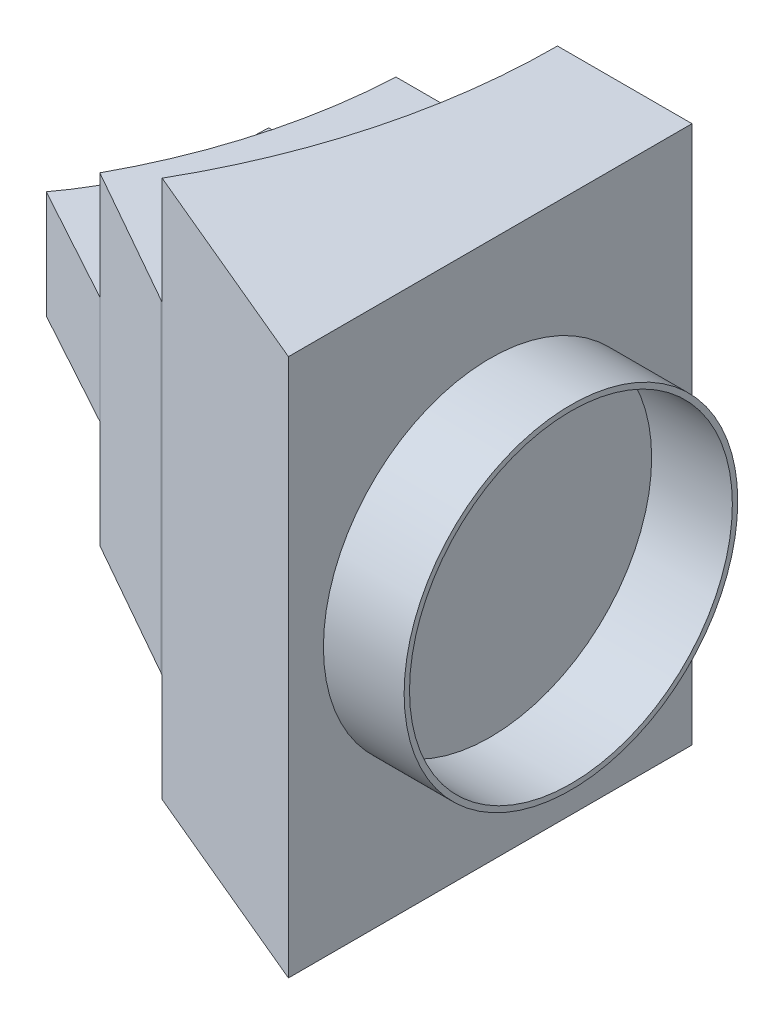
ISO-10303-21;
HEADER;
FILE_DESCRIPTION(('STEP AP214'),'2;1');
FILE_NAME('part.step','',(''),(''),'','','');
FILE_SCHEMA(('AUTOMOTIVE_DESIGN { 1 0 10303 214 1 1 1 1 }'));
ENDSEC;
DATA;
#1=APPLICATION_CONTEXT('core data for automotive mechanical design processes');
#2=APPLICATION_PROTOCOL_DEFINITION('international standard','automotive_design',2000,#1);
#3=PRODUCT_CONTEXT('',#1,'mechanical');
#4=PRODUCT('Part','Part','',(#3));
#5=PRODUCT_RELATED_PRODUCT_CATEGORY('part','',(#4));
#6=PRODUCT_DEFINITION_FORMATION('','',#4);
#7=PRODUCT_DEFINITION_CONTEXT('part definition',#1,'design');
#8=PRODUCT_DEFINITION('design','',#6,#7);
#9=PRODUCT_DEFINITION_SHAPE('','',#8);
#10=(LENGTH_UNIT() NAMED_UNIT(*) SI_UNIT(.MILLI.,.METRE.));
#11=(NAMED_UNIT(*) PLANE_ANGLE_UNIT() SI_UNIT($,.RADIAN.));
#12=(NAMED_UNIT(*) SI_UNIT($,.STERADIAN.) SOLID_ANGLE_UNIT());
#13=UNCERTAINTY_MEASURE_WITH_UNIT(LENGTH_MEASURE(1.E-05),#10,'distance_accuracy_value','');
#14=(GEOMETRIC_REPRESENTATION_CONTEXT(3) GLOBAL_UNCERTAINTY_ASSIGNED_CONTEXT((#13)) GLOBAL_UNIT_ASSIGNED_CONTEXT((#10,
#11,#12)) REPRESENTATION_CONTEXT('',''));
#15=CARTESIAN_POINT('',(0.,0.,0.));
#16=DIRECTION('',(0.,0.,1.));
#17=DIRECTION('',(1.,0.,0.));
#18=AXIS2_PLACEMENT_3D('',#15,#16,#17);
#19=CARTESIAN_POINT('',(0.,60.,0.));
#20=DIRECTION('',(0.,-1.,0.));
#21=DIRECTION('',(0.,0.,-1.));
#22=AXIS2_PLACEMENT_3D('',#19,#20,#21);
#23=CYLINDRICAL_SURFACE('',#22,100.);
#24=CARTESIAN_POINT('',(-1.01307850997046E-12,40.,-3.33066907387547E-13));
#25=DIRECTION('',(0.,1.,0.));
#26=DIRECTION('',(0.,0.,-1.));
#27=AXIS2_PLACEMENT_3D('',#24,#25,#26);
#28=CIRCLE('',#27,100.000000000001);
#29=CARTESIAN_POINT('',(87.7609616658955,40.,47.9376011860963));
#30=VERTEX_POINT('',#29);
#31=CARTESIAN_POINT('',(99.8749217771909,40.,5.));
#32=VERTEX_POINT('',#31);
#33=EDGE_CURVE('E143',#30,#32,#28,.T.);
#34=ORIENTED_EDGE('',*,*,#33,.F.);
#35=DIRECTION('',(0.,-1.,0.));
#36=VECTOR('',#35,1.);
#37=CARTESIAN_POINT('',(87.7609616658955,60.,47.9376011860963));
#38=LINE('',#37,#36);
#39=CARTESIAN_POINT('',(87.7609616658955,60.,47.9376011860963));
#40=VERTEX_POINT('',#39);
#41=EDGE_CURVE('E41',#40,#30,#38,.T.);
#42=ORIENTED_EDGE('',*,*,#41,.F.);
#43=CARTESIAN_POINT('',(0.,60.,0.));
#44=DIRECTION('',(0.,-1.,0.));
#45=DIRECTION('',(0.,0.,-1.));
#46=AXIS2_PLACEMENT_3D('',#43,#44,#45);
#47=CIRCLE('',#46,100.);
#48=CARTESIAN_POINT('',(99.8749217771909,60.,5.));
#49=VERTEX_POINT('',#48);
#50=EDGE_CURVE('E57',#49,#40,#47,.T.);
#51=ORIENTED_EDGE('',*,*,#50,.F.);
#52=DIRECTION('',(0.,-1.,0.));
#53=VECTOR('',#52,1.);
#54=CARTESIAN_POINT('',(99.8749217771909,60.,5.));
#55=LINE('',#54,#53);
#56=EDGE_CURVE('E115',#49,#32,#55,.T.);
#57=ORIENTED_EDGE('',*,*,#56,.T.);
#58=EDGE_LOOP('',(#34,#42,#51,#57));
#59=FACE_BOUND('',#58,.T.);
#60=ADVANCED_FACE('F33',(#59),#23,.F.);
#61=CARTESIAN_POINT('',(87.7609616658955,60.,47.9376011860963));
#62=DIRECTION('',(0.492049327323064,0.,-0.87056732047609));
#63=DIRECTION('',(-0.87056732047609,0.,-0.492049327323064));
#64=AXIS2_PLACEMENT_3D('',#61,#62,#63);
#65=PLANE('',#64);
#66=DIRECTION('',(0.870567320476091,0.,0.492049327323064));
#67=VECTOR('',#66,1.);
#68=CARTESIAN_POINT('',(87.7609616658955,0.,47.9376011860963));
#69=LINE('',#68,#67);
#70=CARTESIAN_POINT('',(87.7609616658955,0.,47.9376011860963));
#71=VERTEX_POINT('',#70);
#72=CARTESIAN_POINT('',(113.877981280178,0.,62.6990810057883));
#73=VERTEX_POINT('',#72);
#74=EDGE_CURVE('E171',#71,#73,#69,.T.);
#75=ORIENTED_EDGE('',*,*,#74,.T.);
#76=DIRECTION('',(0.,-1.,0.));
#77=VECTOR('',#76,1.);
#78=CARTESIAN_POINT('',(113.877981280178,60.,62.6990810057883));
#79=LINE('',#78,#77);
#80=CARTESIAN_POINT('',(113.877981280178,60.,62.6990810057883));
#81=VERTEX_POINT('',#80);
#82=EDGE_CURVE('E114',#81,#73,#79,.T.);
#83=ORIENTED_EDGE('',*,*,#82,.F.);
#84=DIRECTION('',(0.870567320476091,0.,0.492049327323064));
#85=VECTOR('',#84,1.);
#86=CARTESIAN_POINT('',(87.7609616658955,60.,47.9376011860963));
#87=LINE('',#86,#85);
#88=EDGE_CURVE('E88',#40,#81,#87,.T.);
#89=ORIENTED_EDGE('',*,*,#88,.F.);
#90=ORIENTED_EDGE('',*,*,#41,.T.);
#91=DIRECTION('',(0.,-1.,0.));
#92=VECTOR('',#91,1.);
#93=CARTESIAN_POINT('',(87.7609616658955,40.,47.9376011860963));
#94=LINE('',#93,#92);
#95=CARTESIAN_POINT('',(87.7609616658955,20.,47.9376011860963));
#96=VERTEX_POINT('',#95);
#97=EDGE_CURVE('E155',#30,#96,#94,.T.);
#98=ORIENTED_EDGE('',*,*,#97,.T.);
#99=EDGE_CURVE('E185',#96,#71,#38,.T.);
#100=ORIENTED_EDGE('',*,*,#99,.T.);
#101=EDGE_LOOP('',(#75,#83,#89,#90,#98,#100));
#102=FACE_BOUND('',#101,.T.);
#103=ADVANCED_FACE('F35',(#102),#65,.F.);
#104=CARTESIAN_POINT('',(113.877981280178,60.,62.6990810057883));
#105=DIRECTION('',(0.497945582213122,0.,-0.867208277840125));
#106=DIRECTION('',(-0.867208277840125,0.,-0.497945582213122));
#107=AXIS2_PLACEMENT_3D('',#104,#105,#106);
#108=PLANE('',#107);
#109=DIRECTION('',(0.867208277840125,0.,0.497945582213122));
#110=VECTOR('',#109,1.);
#111=CARTESIAN_POINT('',(113.877981280178,0.,62.6990810057883));
#112=LINE('',#111,#110);
#113=CARTESIAN_POINT('',(114.4068019266,0.,63.0027265214013));
#114=VERTEX_POINT('',#113);
#115=EDGE_CURVE('E109',#73,#114,#112,.T.);
#116=ORIENTED_EDGE('',*,*,#115,.T.);
#117=DIRECTION('',(0.,-1.,0.));
#118=VECTOR('',#117,1.);
#119=CARTESIAN_POINT('',(114.4068019266,60.,63.0027265214013));
#120=LINE('',#119,#118);
#121=CARTESIAN_POINT('',(114.4068019266,60.,63.0027265214013));
#122=VERTEX_POINT('',#121);
#123=EDGE_CURVE('E106',#122,#114,#120,.T.);
#124=ORIENTED_EDGE('',*,*,#123,.F.);
#125=DIRECTION('',(0.867208277840125,0.,0.497945582213122));
#126=VECTOR('',#125,1.);
#127=CARTESIAN_POINT('',(113.877981280178,60.,62.6990810057883));
#128=LINE('',#127,#126);
#129=EDGE_CURVE('E96',#81,#122,#128,.T.);
#130=ORIENTED_EDGE('',*,*,#129,.F.);
#131=ORIENTED_EDGE('',*,*,#82,.T.);
#132=EDGE_LOOP('',(#116,#124,#130,#131));
#133=FACE_BOUND('',#132,.T.);
#134=ADVANCED_FACE('F107',(#133),#108,.F.);
#135=CARTESIAN_POINT('',(99.8749217771909,60.,5.));
#136=DIRECTION('',(0.,0.,1.));
#137=DIRECTION('',(1.,0.,0.));
#138=AXIS2_PLACEMENT_3D('',#135,#136,#137);
#139=PLANE('',#138);
#140=DIRECTION('',(-1.,0.,0.));
#141=VECTOR('',#140,1.);
#142=CARTESIAN_POINT('',(99.8749217771909,0.,5.));
#143=LINE('',#142,#141);
#144=CARTESIAN_POINT('',(129.874921777191,0.,5.));
#145=VERTEX_POINT('',#144);
#146=CARTESIAN_POINT('',(99.8749217771909,0.,5.));
#147=VERTEX_POINT('',#146);
#148=EDGE_CURVE('E181',#145,#147,#143,.T.);
#149=ORIENTED_EDGE('',*,*,#148,.T.);
#150=CARTESIAN_POINT('',(99.8749217771909,20.,5.));
#151=VERTEX_POINT('',#150);
#152=EDGE_CURVE('E79',#151,#147,#55,.T.);
#153=ORIENTED_EDGE('',*,*,#152,.F.);
#154=DIRECTION('',(-1.,0.,0.));
#155=VECTOR('',#154,1.);
#156=CARTESIAN_POINT('',(99.8749217771909,20.,5.));
#157=LINE('',#156,#155);
#158=CARTESIAN_POINT('',(76.203852603094,20.,5.));
#159=VERTEX_POINT('',#158);
#160=EDGE_CURVE('E48',#151,#159,#157,.T.);
#161=ORIENTED_EDGE('',*,*,#160,.T.);
#162=DIRECTION('',(0.,-1.,0.));
#163=VECTOR('',#162,1.);
#164=CARTESIAN_POINT('',(76.203852603094,40.,5.));
#165=LINE('',#164,#163);
#166=CARTESIAN_POINT('',(76.203852603094,40.,5.));
#167=VERTEX_POINT('',#166);
#168=EDGE_CURVE('E168',#167,#159,#165,.T.);
#169=ORIENTED_EDGE('',*,*,#168,.F.);
#170=DIRECTION('',(-1.,0.,0.));
#171=VECTOR('',#170,1.);
#172=CARTESIAN_POINT('',(99.8749217771909,40.,5.));
#173=LINE('',#172,#171);
#174=EDGE_CURVE('E146',#32,#167,#173,.T.);
#175=ORIENTED_EDGE('',*,*,#174,.F.);
#176=ORIENTED_EDGE('',*,*,#56,.F.);
#177=DIRECTION('',(-1.,0.,0.));
#178=VECTOR('',#177,1.);
#179=CARTESIAN_POINT('',(99.8749217771909,60.,5.));
#180=LINE('',#179,#178);
#181=CARTESIAN_POINT('',(129.874921777191,60.,5.));
#182=VERTEX_POINT('',#181);
#183=EDGE_CURVE('E126',#182,#49,#180,.T.);
#184=ORIENTED_EDGE('',*,*,#183,.F.);
#185=DIRECTION('',(0.,-1.,0.));
#186=VECTOR('',#185,1.);
#187=CARTESIAN_POINT('',(129.874921777191,80.,5.));
#188=LINE('',#187,#186);
#189=CARTESIAN_POINT('',(129.874921777191,80.,5.));
#190=VERTEX_POINT('',#189);
#191=EDGE_CURVE('E125',#190,#182,#188,.T.);
#192=ORIENTED_EDGE('',*,*,#191,.F.);
#193=DIRECTION('',(-1.,0.,0.));
#194=VECTOR('',#193,1.);
#195=CARTESIAN_POINT('',(129.874921777191,80.,5.));
#196=LINE('',#195,#194);
#197=CARTESIAN_POINT('',(154.874921777191,80.,5.));
#198=VERTEX_POINT('',#197);
#199=EDGE_CURVE('E272',#198,#190,#196,.T.);
#200=ORIENTED_EDGE('',*,*,#199,.F.);
#201=DIRECTION('',(0.,-1.,0.));
#202=VECTOR('',#201,1.);
#203=CARTESIAN_POINT('',(154.874921777191,80.,5.));
#204=LINE('',#203,#202);
#205=CARTESIAN_POINT('',(154.874921777191,-20.,5.));
#206=VERTEX_POINT('',#205);
#207=EDGE_CURVE('E226',#198,#206,#204,.T.);
#208=ORIENTED_EDGE('',*,*,#207,.T.);
#209=DIRECTION('',(-1.,0.,0.));
#210=VECTOR('',#209,1.);
#211=CARTESIAN_POINT('',(129.874921777191,-20.,5.));
#212=LINE('',#211,#210);
#213=CARTESIAN_POINT('',(129.874921777191,-20.,5.));
#214=VERTEX_POINT('',#213);
#215=EDGE_CURVE('E217',#206,#214,#212,.T.);
#216=ORIENTED_EDGE('',*,*,#215,.T.);
#217=EDGE_CURVE('E227',#145,#214,#188,.T.);
#218=ORIENTED_EDGE('',*,*,#217,.F.);
#219=EDGE_LOOP('',(#149,#153,#161,#169,#175,#176,#184,#192,#200,#208,#216,#218));
#220=FACE_BOUND('',#219,.T.);
#221=ADVANCED_FACE('F270',(#220),#139,.F.);
#222=ORIENTED_EDGE('',*,*,#99,.F.);
#223=CARTESIAN_POINT('',(-1.01307850997046E-12,20.,-3.33066907387547E-13));
#224=DIRECTION('',(0.,1.,0.));
#225=DIRECTION('',(0.,0.,-1.));
#226=AXIS2_PLACEMENT_3D('',#223,#224,#225);
#227=CIRCLE('',#226,100.000000000001);
#228=EDGE_CURVE('E135',#96,#151,#227,.T.);
#229=ORIENTED_EDGE('',*,*,#228,.T.);
#230=ORIENTED_EDGE('',*,*,#152,.T.);
#231=CARTESIAN_POINT('',(0.,0.,0.));
#232=DIRECTION('',(0.,-1.,0.));
#233=DIRECTION('',(0.,0.,-1.));
#234=AXIS2_PLACEMENT_3D('',#231,#232,#233);
#235=CIRCLE('',#234,100.);
#236=EDGE_CURVE('E173',#147,#71,#235,.T.);
#237=ORIENTED_EDGE('',*,*,#236,.T.);
#238=EDGE_LOOP('',(#222,#229,#230,#237));
#239=FACE_BOUND('',#238,.T.);
#240=ADVANCED_FACE('F190',(#239),#23,.F.);
#241=CARTESIAN_POINT('',(0.,60.,0.));
#242=DIRECTION('',(0.,-1.,0.));
#243=DIRECTION('',(0.,0.,-1.));
#244=AXIS2_PLACEMENT_3D('',#241,#242,#243);
#245=PLANE('',#244);
#246=ORIENTED_EDGE('',*,*,#50,.T.);
#247=ORIENTED_EDGE('',*,*,#88,.T.);
#248=ORIENTED_EDGE('',*,*,#129,.T.);
#249=CARTESIAN_POINT('',(13.3908548564459,60.,5.00000000000001));
#250=DIRECTION('',(0.,1.,0.));
#251=DIRECTION('',(0.,0.,-1.));
#252=AXIS2_PLACEMENT_3D('',#249,#250,#251);
#253=CIRCLE('',#252,116.484066920745);
#254=EDGE_CURVE('E100',#122,#182,#253,.T.);
#255=ORIENTED_EDGE('',*,*,#254,.T.);
#256=ORIENTED_EDGE('',*,*,#183,.T.);
#257=EDGE_LOOP('',(#246,#247,#248,#255,#256));
#258=FACE_BOUND('',#257,.T.);
#259=ADVANCED_FACE('F98',(#258),#245,.F.);
#260=CARTESIAN_POINT('',(0.,0.,0.));
#261=DIRECTION('',(0.,-1.,0.));
#262=DIRECTION('',(0.,0.,-1.));
#263=AXIS2_PLACEMENT_3D('',#260,#261,#262);
#264=PLANE('',#263);
#265=ORIENTED_EDGE('',*,*,#74,.F.);
#266=ORIENTED_EDGE('',*,*,#236,.F.);
#267=ORIENTED_EDGE('',*,*,#148,.F.);
#268=CARTESIAN_POINT('',(13.3908548564459,0.,5.00000000000001));
#269=DIRECTION('',(0.,1.,0.));
#270=DIRECTION('',(0.,0.,-1.));
#271=AXIS2_PLACEMENT_3D('',#268,#269,#270);
#272=CIRCLE('',#271,116.484066920745);
#273=EDGE_CURVE('E178',#114,#145,#272,.T.);
#274=ORIENTED_EDGE('',*,*,#273,.F.);
#275=ORIENTED_EDGE('',*,*,#115,.F.);
#276=EDGE_LOOP('',(#265,#266,#267,#274,#275));
#277=FACE_BOUND('',#276,.T.);
#278=ADVANCED_FACE('F193',(#277),#264,.T.);
#279=CARTESIAN_POINT('',(24.8749217771909,40.,5.00000000000001));
#280=DIRECTION('',(0.,-1.,0.));
#281=DIRECTION('',(0.,0.,-1.));
#282=AXIS2_PLACEMENT_3D('',#279,#280,#281);
#283=CYLINDRICAL_SURFACE('',#282,51.3289308259031);
#284=CARTESIAN_POINT('',(24.8749217771909,20.,5.00000000000001));
#285=DIRECTION('',(0.,-1.,0.));
#286=DIRECTION('',(0.,0.,1.));
#287=AXIS2_PLACEMENT_3D('',#284,#285,#286);
#288=CIRCLE('',#287,51.3289308259031);
#289=CARTESIAN_POINT('',(65.8207212494216,20.,35.9532008895723));
#290=VERTEX_POINT('',#289);
#291=EDGE_CURVE('E158',#159,#290,#288,.T.);
#292=ORIENTED_EDGE('',*,*,#291,.T.);
#293=DIRECTION('',(0.,-1.,0.));
#294=VECTOR('',#293,1.);
#295=CARTESIAN_POINT('',(65.8207212494216,40.,35.9532008895723));
#296=LINE('',#295,#294);
#297=CARTESIAN_POINT('',(65.8207212494216,40.,35.9532008895723));
#298=VERTEX_POINT('',#297);
#299=EDGE_CURVE('E165',#298,#290,#296,.T.);
#300=ORIENTED_EDGE('',*,*,#299,.F.);
#301=CARTESIAN_POINT('',(24.8749217771909,40.,5.00000000000001));
#302=DIRECTION('',(0.,-1.,0.));
#303=DIRECTION('',(0.,0.,1.));
#304=AXIS2_PLACEMENT_3D('',#301,#302,#303);
#305=CIRCLE('',#304,51.3289308259031);
#306=EDGE_CURVE('E150',#167,#298,#305,.T.);
#307=ORIENTED_EDGE('',*,*,#306,.F.);
#308=ORIENTED_EDGE('',*,*,#168,.T.);
#309=EDGE_LOOP('',(#292,#300,#307,#308));
#310=FACE_BOUND('',#309,.T.);
#311=ADVANCED_FACE('F339',(#310),#283,.F.);
#312=CARTESIAN_POINT('',(87.7609616658955,40.,47.9376011860963));
#313=DIRECTION('',(0.479376011860962,0.,-0.877609616658956));
#314=DIRECTION('',(-0.877609616658956,0.,-0.479376011860962));
#315=AXIS2_PLACEMENT_3D('',#312,#313,#314);
#316=PLANE('',#315);
#317=DIRECTION('',(0.877609616658956,0.,0.479376011860962));
#318=VECTOR('',#317,1.);
#319=CARTESIAN_POINT('',(87.7609616658955,20.,47.9376011860963));
#320=LINE('',#319,#318);
#321=EDGE_CURVE('E147',#290,#96,#320,.T.);
#322=ORIENTED_EDGE('',*,*,#321,.T.);
#323=ORIENTED_EDGE('',*,*,#97,.F.);
#324=DIRECTION('',(0.877609616658956,0.,0.479376011860962));
#325=VECTOR('',#324,1.);
#326=CARTESIAN_POINT('',(87.7609616658955,40.,47.9376011860963));
#327=LINE('',#326,#325);
#328=EDGE_CURVE('E153',#298,#30,#327,.T.);
#329=ORIENTED_EDGE('',*,*,#328,.F.);
#330=ORIENTED_EDGE('',*,*,#299,.T.);
#331=EDGE_LOOP('',(#322,#323,#329,#330));
#332=FACE_BOUND('',#331,.T.);
#333=ADVANCED_FACE('F266',(#332),#316,.F.);
#334=CARTESIAN_POINT('',(-1.01307850997046E-12,40.,-3.33066907387547E-13));
#335=DIRECTION('',(0.,-1.,0.));
#336=DIRECTION('',(0.,0.,-1.));
#337=AXIS2_PLACEMENT_3D('',#334,#335,#336);
#338=PLANE('',#337);
#339=ORIENTED_EDGE('',*,*,#33,.T.);
#340=ORIENTED_EDGE('',*,*,#174,.T.);
#341=ORIENTED_EDGE('',*,*,#306,.T.);
#342=ORIENTED_EDGE('',*,*,#328,.T.);
#343=EDGE_LOOP('',(#339,#340,#341,#342));
#344=FACE_BOUND('',#343,.T.);
#345=ADVANCED_FACE('F354',(#344),#338,.F.);
#346=CARTESIAN_POINT('',(-1.01307850997046E-12,20.,-3.33066907387547E-13));
#347=DIRECTION('',(0.,-1.,0.));
#348=DIRECTION('',(0.,0.,-1.));
#349=AXIS2_PLACEMENT_3D('',#346,#347,#348);
#350=PLANE('',#349);
#351=ORIENTED_EDGE('',*,*,#228,.F.);
#352=ORIENTED_EDGE('',*,*,#321,.F.);
#353=ORIENTED_EDGE('',*,*,#291,.F.);
#354=ORIENTED_EDGE('',*,*,#160,.F.);
#355=EDGE_LOOP('',(#351,#352,#353,#354));
#356=FACE_BOUND('',#355,.T.);
#357=ADVANCED_FACE('F269',(#356),#350,.T.);
#358=CARTESIAN_POINT('',(13.3908548564334,80.,4.99999999999665));
#359=DIRECTION('',(0.,-1.,0.));
#360=DIRECTION('',(0.,0.,-1.));
#361=AXIS2_PLACEMENT_3D('',#358,#359,#360);
#362=CYLINDRICAL_SURFACE('',#361,116.484066920758);
#363=ORIENTED_EDGE('',*,*,#191,.T.);
#364=ORIENTED_EDGE('',*,*,#254,.F.);
#365=DIRECTION('',(0.,-1.,0.));
#366=VECTOR('',#365,1.);
#367=CARTESIAN_POINT('',(114.4068019266,80.,63.0027265214013));
#368=LINE('',#367,#366);
#369=CARTESIAN_POINT('',(114.4068019266,80.,63.0027265214013));
#370=VERTEX_POINT('',#369);
#371=EDGE_CURVE('E123',#370,#122,#368,.T.);
#372=ORIENTED_EDGE('',*,*,#371,.F.);
#373=CARTESIAN_POINT('',(13.3908548564334,80.,4.99999999999665));
#374=DIRECTION('',(0.,-1.,0.));
#375=DIRECTION('',(0.,0.,-1.));
#376=AXIS2_PLACEMENT_3D('',#373,#374,#375);
#377=CIRCLE('',#376,116.484066920758);
#378=EDGE_CURVE('E225',#190,#370,#377,.T.);
#379=ORIENTED_EDGE('',*,*,#378,.F.);
#380=EDGE_LOOP('',(#363,#364,#372,#379));
#381=FACE_BOUND('',#380,.T.);
#382=ADVANCED_FACE('F120',(#381),#362,.F.);
#383=ORIENTED_EDGE('',*,*,#273,.T.);
#384=ORIENTED_EDGE('',*,*,#217,.T.);
#385=CARTESIAN_POINT('',(13.3908548564334,-20.,4.99999999999665));
#386=DIRECTION('',(0.,-1.,0.));
#387=DIRECTION('',(0.,0.,-1.));
#388=AXIS2_PLACEMENT_3D('',#385,#386,#387);
#389=CIRCLE('',#388,116.484066920758);
#390=CARTESIAN_POINT('',(114.4068019266,-20.,63.0027265214013));
#391=VERTEX_POINT('',#390);
#392=EDGE_CURVE('E203',#214,#391,#389,.T.);
#393=ORIENTED_EDGE('',*,*,#392,.T.);
#394=EDGE_CURVE('E136',#114,#391,#368,.T.);
#395=ORIENTED_EDGE('',*,*,#394,.F.);
#396=EDGE_LOOP('',(#383,#384,#393,#395));
#397=FACE_BOUND('',#396,.T.);
#398=ADVANCED_FACE('F200',(#397),#362,.F.);
#399=CARTESIAN_POINT('',(114.4068019266,80.,63.0027265214013));
#400=DIRECTION('',(0.387245327067188,0.,-0.921976711563056));
#401=DIRECTION('',(-0.921976711563056,0.,-0.387245327067188));
#402=AXIS2_PLACEMENT_3D('',#399,#400,#401);
#403=PLANE('',#402);
#404=DIRECTION('',(0.921976711563056,0.,0.387245327067188));
#405=VECTOR('',#404,1.);
#406=CARTESIAN_POINT('',(114.4068019266,-20.,63.0027265214013));
#407=LINE('',#406,#405);
#408=CARTESIAN_POINT('',(154.874921777191,-20.,80.));
#409=VERTEX_POINT('',#408);
#410=EDGE_CURVE('E206',#391,#409,#407,.T.);
#411=ORIENTED_EDGE('',*,*,#410,.T.);
#412=DIRECTION('',(0.,-1.,0.));
#413=VECTOR('',#412,1.);
#414=CARTESIAN_POINT('',(154.874921777191,80.,80.));
#415=LINE('',#414,#413);
#416=CARTESIAN_POINT('',(154.874921777191,80.,80.));
#417=VERTEX_POINT('',#416);
#418=EDGE_CURVE('E139',#417,#409,#415,.T.);
#419=ORIENTED_EDGE('',*,*,#418,.F.);
#420=DIRECTION('',(0.921976711563056,0.,0.387245327067188));
#421=VECTOR('',#420,1.);
#422=CARTESIAN_POINT('',(114.4068019266,80.,63.0027265214013));
#423=LINE('',#422,#421);
#424=EDGE_CURVE('E133',#370,#417,#423,.T.);
#425=ORIENTED_EDGE('',*,*,#424,.F.);
#426=ORIENTED_EDGE('',*,*,#371,.T.);
#427=ORIENTED_EDGE('',*,*,#123,.T.);
#428=ORIENTED_EDGE('',*,*,#394,.T.);
#429=EDGE_LOOP('',(#411,#419,#425,#426,#427,#428));
#430=FACE_BOUND('',#429,.T.);
#431=ADVANCED_FACE('F130',(#430),#403,.F.);
#432=CARTESIAN_POINT('',(154.874921777191,80.,5.));
#433=DIRECTION('',(-1.,0.,0.));
#434=DIRECTION('',(0.,0.,1.));
#435=AXIS2_PLACEMENT_3D('',#432,#433,#434);
#436=PLANE('',#435);
#437=CARTESIAN_POINT('',(154.874921777191,30.,42.5));
#438=DIRECTION('',(-1.,0.,0.));
#439=DIRECTION('',(0.,0.,1.));
#440=AXIS2_PLACEMENT_3D('',#437,#438,#439);
#441=CIRCLE('',#440,31.);
#442=CARTESIAN_POINT('',(154.874921777191,30.,73.5));
#443=VERTEX_POINT('',#442);
#444=EDGE_CURVE('E11',#443,#443,#441,.F.);
#445=ORIENTED_EDGE('',*,*,#444,.F.);
#446=EDGE_LOOP('',(#445));
#447=FACE_BOUND('',#446,.T.);
#448=DIRECTION('',(0.,0.,-1.));
#449=VECTOR('',#448,1.);
#450=CARTESIAN_POINT('',(154.874921777191,-20.,5.));
#451=LINE('',#450,#449);
#452=EDGE_CURVE('E215',#409,#206,#451,.T.);
#453=ORIENTED_EDGE('',*,*,#452,.T.);
#454=ORIENTED_EDGE('',*,*,#207,.F.);
#455=DIRECTION('',(0.,0.,-1.));
#456=VECTOR('',#455,1.);
#457=CARTESIAN_POINT('',(154.874921777191,80.,80.));
#458=LINE('',#457,#456);
#459=EDGE_CURVE('E238',#417,#198,#458,.T.);
#460=ORIENTED_EDGE('',*,*,#459,.F.);
#461=ORIENTED_EDGE('',*,*,#418,.T.);
#462=EDGE_LOOP('',(#453,#454,#460,#461));
#463=FACE_BOUND('',#462,.T.);
#464=ADVANCED_FACE('F235',(#447,#463),#436,.F.);
#465=CARTESIAN_POINT('',(13.3908548564334,80.,4.99999999999665));
#466=DIRECTION('',(0.,-1.,0.));
#467=DIRECTION('',(0.,0.,-1.));
#468=AXIS2_PLACEMENT_3D('',#465,#466,#467);
#469=PLANE('',#468);
#470=ORIENTED_EDGE('',*,*,#378,.T.);
#471=ORIENTED_EDGE('',*,*,#424,.T.);
#472=ORIENTED_EDGE('',*,*,#459,.T.);
#473=ORIENTED_EDGE('',*,*,#199,.T.);
#474=EDGE_LOOP('',(#470,#471,#472,#473));
#475=FACE_BOUND('',#474,.T.);
#476=ADVANCED_FACE('F300',(#475),#469,.F.);
#477=CARTESIAN_POINT('',(13.3908548564334,-20.,4.99999999999665));
#478=DIRECTION('',(0.,-1.,0.));
#479=DIRECTION('',(0.,0.,-1.));
#480=AXIS2_PLACEMENT_3D('',#477,#478,#479);
#481=PLANE('',#480);
#482=ORIENTED_EDGE('',*,*,#392,.F.);
#483=ORIENTED_EDGE('',*,*,#215,.F.);
#484=ORIENTED_EDGE('',*,*,#452,.F.);
#485=ORIENTED_EDGE('',*,*,#410,.F.);
#486=EDGE_LOOP('',(#482,#483,#484,#485));
#487=FACE_BOUND('',#486,.T.);
#488=ADVANCED_FACE('F211',(#487),#481,.T.);
#489=CARTESIAN_POINT('',(169.874921777191,30.,42.5));
#490=DIRECTION('',(1.,0.,0.));
#491=DIRECTION('',(0.,0.,-1.));
#492=AXIS2_PLACEMENT_3D('',#489,#490,#491);
#493=PLANE('',#492);
#494=CARTESIAN_POINT('',(169.874921777191,30.,42.5));
#495=DIRECTION('',(1.,0.,0.));
#496=DIRECTION('',(0.,0.,-1.));
#497=AXIS2_PLACEMENT_3D('',#494,#495,#496);
#498=CIRCLE('',#497,31.);
#499=CARTESIAN_POINT('',(169.874921777191,30.,11.5));
#500=VERTEX_POINT('',#499);
#501=EDGE_CURVE('E219',#500,#500,#498,.T.);
#502=ORIENTED_EDGE('',*,*,#501,.T.);
#503=EDGE_LOOP('',(#502));
#504=FACE_BOUND('',#503,.T.);
#505=CARTESIAN_POINT('',(169.874921777191,30.,42.5));
#506=DIRECTION('',(1.,0.,0.));
#507=DIRECTION('',(0.,0.,-1.));
#508=AXIS2_PLACEMENT_3D('',#505,#506,#507);
#509=CIRCLE('',#508,30.);
#510=CARTESIAN_POINT('',(169.874921777191,30.,12.5));
#511=VERTEX_POINT('',#510);
#512=EDGE_CURVE('E279',#511,#511,#509,.T.);
#513=ORIENTED_EDGE('',*,*,#512,.F.);
#514=EDGE_LOOP('',(#513));
#515=FACE_BOUND('',#514,.T.);
#516=ADVANCED_FACE('F289',(#504,#515),#493,.T.);
#517=CARTESIAN_POINT('',(169.874921777191,30.,42.5));
#518=DIRECTION('',(-1.,0.,0.));
#519=DIRECTION('',(0.,0.,1.));
#520=AXIS2_PLACEMENT_3D('',#517,#518,#519);
#521=CYLINDRICAL_SURFACE('',#520,31.);
#522=ORIENTED_EDGE('',*,*,#501,.F.);
#523=EDGE_LOOP('',(#522));
#524=FACE_BOUND('',#523,.T.);
#525=ORIENTED_EDGE('',*,*,#444,.T.);
#526=EDGE_LOOP('',(#525));
#527=FACE_BOUND('',#526,.T.);
#528=ADVANCED_FACE('F291',(#524,#527),#521,.T.);
#529=CARTESIAN_POINT('',(169.874921777191,30.,42.5));
#530=DIRECTION('',(-1.,0.,0.));
#531=DIRECTION('',(0.,0.,1.));
#532=AXIS2_PLACEMENT_3D('',#529,#530,#531);
#533=CYLINDRICAL_SURFACE('',#532,30.);
#534=ORIENTED_EDGE('',*,*,#512,.T.);
#535=EDGE_LOOP('',(#534));
#536=FACE_BOUND('',#535,.T.);
#537=CARTESIAN_POINT('',(154.874921777191,30.,42.5));
#538=DIRECTION('',(1.,0.,0.));
#539=DIRECTION('',(0.,0.,-1.));
#540=AXIS2_PLACEMENT_3D('',#537,#538,#539);
#541=CIRCLE('',#540,30.);
#542=CARTESIAN_POINT('',(154.874921777191,30.,12.5));
#543=VERTEX_POINT('',#542);
#544=EDGE_CURVE('E280',#543,#543,#541,.T.);
#545=ORIENTED_EDGE('',*,*,#544,.F.);
#546=EDGE_LOOP('',(#545));
#547=FACE_BOUND('',#546,.T.);
#548=ADVANCED_FACE('F286',(#536,#547),#533,.F.);
#549=ORIENTED_EDGE('',*,*,#544,.T.);
#550=EDGE_LOOP('',(#549));
#551=FACE_BOUND('',#550,.T.);
#552=ADVANCED_FACE('F400',(#551),#436,.F.);
#553=CLOSED_SHELL('',(#60,#103,#134,#221,#240,#259,#278,#311,#333,#345,#357,#382,#398,#431,#464,
#476,#488,#516,#528,#548,#552));
#554=MANIFOLD_SOLID_BREP('B2',#553);
#555=ADVANCED_BREP_SHAPE_REPRESENTATION('',(#18,#554),#14);
#556=SHAPE_DEFINITION_REPRESENTATION(#9,#555);
ENDSEC;
END-ISO-10303-21;
